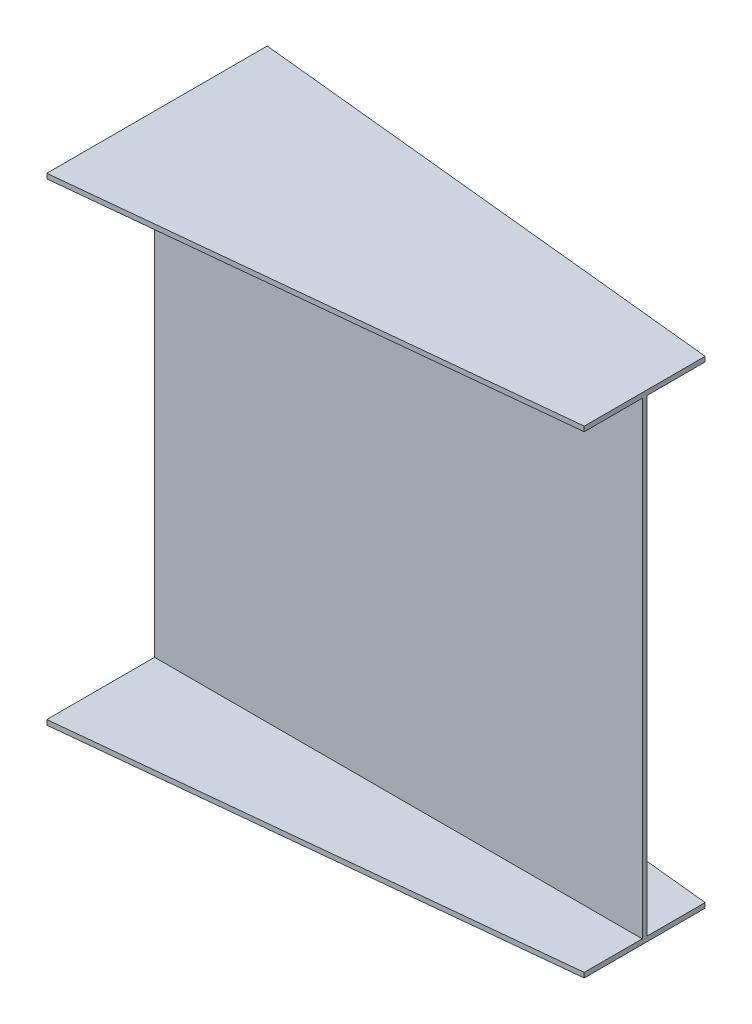
ISO-10303-21;
HEADER;
FILE_DESCRIPTION(('STEP AP214'),'2;1');
FILE_NAME('part.step','',(''),(''),'','','');
FILE_SCHEMA(('AUTOMOTIVE_DESIGN { 1 0 10303 214 1 1 1 1 }'));
ENDSEC;
DATA;
#1=APPLICATION_CONTEXT('core data for automotive mechanical design processes');
#2=APPLICATION_PROTOCOL_DEFINITION('international standard','automotive_design',2000,#1);
#3=PRODUCT_CONTEXT('',#1,'mechanical');
#4=PRODUCT('Part','Part','',(#3));
#5=PRODUCT_RELATED_PRODUCT_CATEGORY('part','',(#4));
#6=PRODUCT_DEFINITION_FORMATION('','',#4);
#7=PRODUCT_DEFINITION_CONTEXT('part definition',#1,'design');
#8=PRODUCT_DEFINITION('design','',#6,#7);
#9=PRODUCT_DEFINITION_SHAPE('','',#8);
#10=(LENGTH_UNIT() NAMED_UNIT(*) SI_UNIT(.MILLI.,.METRE.));
#11=(NAMED_UNIT(*) PLANE_ANGLE_UNIT() SI_UNIT($,.RADIAN.));
#12=(NAMED_UNIT(*) SI_UNIT($,.STERADIAN.) SOLID_ANGLE_UNIT());
#13=UNCERTAINTY_MEASURE_WITH_UNIT(LENGTH_MEASURE(1.E-05),#10,'distance_accuracy_value','');
#14=(GEOMETRIC_REPRESENTATION_CONTEXT(3) GLOBAL_UNCERTAINTY_ASSIGNED_CONTEXT((#13)) GLOBAL_UNIT_ASSIGNED_CONTEXT((#10,
#11,#12)) REPRESENTATION_CONTEXT('',''));
#15=CARTESIAN_POINT('',(0.,0.,0.));
#16=DIRECTION('',(0.,0.,1.));
#17=DIRECTION('',(1.,0.,0.));
#18=AXIS2_PLACEMENT_3D('',#15,#16,#17);
#19=CARTESIAN_POINT('',(1000.,0.,0.));
#20=DIRECTION('',(-1.,0.,0.));
#21=DIRECTION('',(0.,0.,1.));
#22=AXIS2_PLACEMENT_3D('',#19,#20,#21);
#23=PLANE('',#22);
#24=DIRECTION('',(0.,-1.,0.));
#25=VECTOR('',#24,1.);
#26=CARTESIAN_POINT('',(1000.,490.,-119.));
#27=LINE('',#26,#25);
#28=CARTESIAN_POINT('',(1000.,490.,-119.));
#29=VERTEX_POINT('',#28);
#30=CARTESIAN_POINT('',(1000.,480.,-119.));
#31=VERTEX_POINT('',#30);
#32=EDGE_CURVE('E377',#29,#31,#27,.T.);
#33=ORIENTED_EDGE('',*,*,#32,.F.);
#34=DIRECTION('',(0.,0.,-1.));
#35=VECTOR('',#34,1.);
#36=CARTESIAN_POINT('',(1000.,490.,-119.));
#37=LINE('',#36,#35);
#38=CARTESIAN_POINT('',(1000.,490.,129.));
#39=VERTEX_POINT('',#38);
#40=EDGE_CURVE('E12',#39,#29,#37,.T.);
#41=ORIENTED_EDGE('',*,*,#40,.F.);
#42=DIRECTION('',(0.,1.,0.));
#43=VECTOR('',#42,1.);
#44=CARTESIAN_POINT('',(1000.,490.,129.));
#45=LINE('',#44,#43);
#46=CARTESIAN_POINT('',(1000.,480.,129.));
#47=VERTEX_POINT('',#46);
#48=EDGE_CURVE('E71',#47,#39,#45,.T.);
#49=ORIENTED_EDGE('',*,*,#48,.F.);
#50=DIRECTION('',(0.,0.,1.));
#51=VECTOR('',#50,1.);
#52=CARTESIAN_POINT('',(1000.,480.,10.0000000000002));
#53=LINE('',#52,#51);
#54=CARTESIAN_POINT('',(1000.,480.,10.0000000000002));
#55=VERTEX_POINT('',#54);
#56=EDGE_CURVE('E652',#55,#47,#53,.T.);
#57=ORIENTED_EDGE('',*,*,#56,.F.);
#58=DIRECTION('',(0.,1.,0.));
#59=VECTOR('',#58,1.);
#60=CARTESIAN_POINT('',(1000.,480.,10.0000000000002));
#61=LINE('',#60,#59);
#62=CARTESIAN_POINT('',(1000.,-480.,10.0000000000002));
#63=VERTEX_POINT('',#62);
#64=EDGE_CURVE('E414',#63,#55,#61,.T.);
#65=ORIENTED_EDGE('',*,*,#64,.F.);
#66=DIRECTION('',(0.,0.,-1.));
#67=VECTOR('',#66,1.);
#68=CARTESIAN_POINT('',(1000.,-480.,10.0000000000002));
#69=LINE('',#68,#67);
#70=CARTESIAN_POINT('',(1000.,-480.,129.));
#71=VERTEX_POINT('',#70);
#72=EDGE_CURVE('E428',#71,#63,#69,.T.);
#73=ORIENTED_EDGE('',*,*,#72,.F.);
#74=DIRECTION('',(0.,1.,0.));
#75=VECTOR('',#74,1.);
#76=CARTESIAN_POINT('',(1000.,-480.,129.));
#77=LINE('',#76,#75);
#78=CARTESIAN_POINT('',(1000.,-490.,129.));
#79=VERTEX_POINT('',#78);
#80=EDGE_CURVE('E442',#79,#71,#77,.T.);
#81=ORIENTED_EDGE('',*,*,#80,.F.);
#82=DIRECTION('',(0.,0.,1.));
#83=VECTOR('',#82,1.);
#84=CARTESIAN_POINT('',(1000.,-490.,-119.));
#85=LINE('',#84,#83);
#86=CARTESIAN_POINT('',(1000.,-490.,-119.));
#87=VERTEX_POINT('',#86);
#88=EDGE_CURVE('E623',#87,#79,#85,.T.);
#89=ORIENTED_EDGE('',*,*,#88,.F.);
#90=DIRECTION('',(0.,-1.,0.));
#91=VECTOR('',#90,1.);
#92=CARTESIAN_POINT('',(1000.,-480.,-119.));
#93=LINE('',#92,#91);
#94=CARTESIAN_POINT('',(1000.,-480.,-119.));
#95=VERTEX_POINT('',#94);
#96=EDGE_CURVE('E615',#95,#87,#93,.T.);
#97=ORIENTED_EDGE('',*,*,#96,.F.);
#98=DIRECTION('',(0.,0.,-1.));
#99=VECTOR('',#98,1.);
#100=CARTESIAN_POINT('',(1000.,-480.,-119.));
#101=LINE('',#100,#99);
#102=CARTESIAN_POINT('',(1000.,-480.,2.22044604925031E-13));
#103=VERTEX_POINT('',#102);
#104=EDGE_CURVE('E530',#103,#95,#101,.T.);
#105=ORIENTED_EDGE('',*,*,#104,.F.);
#106=DIRECTION('',(0.,-1.,0.));
#107=VECTOR('',#106,1.);
#108=CARTESIAN_POINT('',(1000.,480.,2.22044604925031E-13));
#109=LINE('',#108,#107);
#110=CARTESIAN_POINT('',(1000.,480.,2.22044604925031E-13));
#111=VERTEX_POINT('',#110);
#112=EDGE_CURVE('E85',#111,#103,#109,.T.);
#113=ORIENTED_EDGE('',*,*,#112,.F.);
#114=DIRECTION('',(0.,0.,1.));
#115=VECTOR('',#114,1.);
#116=CARTESIAN_POINT('',(1000.,480.,-119.));
#117=LINE('',#116,#115);
#118=EDGE_CURVE('E79',#31,#111,#117,.T.);
#119=ORIENTED_EDGE('',*,*,#118,.F.);
#120=EDGE_LOOP('',(#33,#41,#49,#57,#65,#73,#81,#89,#97,#105,#113,#119));
#121=FACE_BOUND('',#120,.T.);
#122=ADVANCED_FACE('F61',(#121),#23,.F.);
#123=CARTESIAN_POINT('',(0.,0.,0.));
#124=DIRECTION('',(1.,0.,0.));
#125=DIRECTION('',(0.,0.,-1.));
#126=AXIS2_PLACEMENT_3D('',#123,#124,#125);
#127=PLANE('',#126);
#128=DIRECTION('',(0.,-1.,0.));
#129=VECTOR('',#128,1.);
#130=CARTESIAN_POINT('',(0.,490.,231.000000000001));
#131=LINE('',#130,#129);
#132=CARTESIAN_POINT('',(0.,490.,231.000000000001));
#133=VERTEX_POINT('',#132);
#134=CARTESIAN_POINT('',(0.,480.,231.000000000001));
#135=VERTEX_POINT('',#134);
#136=EDGE_CURVE('E160',#133,#135,#131,.T.);
#137=ORIENTED_EDGE('',*,*,#136,.F.);
#138=DIRECTION('',(0.,0.,1.));
#139=VECTOR('',#138,1.);
#140=CARTESIAN_POINT('',(0.,490.,231.000000000001));
#141=LINE('',#140,#139);
#142=CARTESIAN_POINT('',(0.,490.,-220.999999999999));
#143=VERTEX_POINT('',#142);
#144=EDGE_CURVE('E169',#143,#133,#141,.T.);
#145=ORIENTED_EDGE('',*,*,#144,.F.);
#146=DIRECTION('',(0.,1.,0.));
#147=VECTOR('',#146,1.);
#148=CARTESIAN_POINT('',(0.,490.,-220.999999999999));
#149=LINE('',#148,#147);
#150=CARTESIAN_POINT('',(0.,480.,-220.999999999999));
#151=VERTEX_POINT('',#150);
#152=EDGE_CURVE('E176',#151,#143,#149,.T.);
#153=ORIENTED_EDGE('',*,*,#152,.F.);
#154=DIRECTION('',(0.,0.,-1.));
#155=VECTOR('',#154,1.);
#156=CARTESIAN_POINT('',(0.,480.,4.7415678223917E-13));
#157=LINE('',#156,#155);
#158=CARTESIAN_POINT('',(0.,480.,4.7415678223917E-13));
#159=VERTEX_POINT('',#158);
#160=EDGE_CURVE('E300',#159,#151,#157,.T.);
#161=ORIENTED_EDGE('',*,*,#160,.F.);
#162=DIRECTION('',(0.,1.,0.));
#163=VECTOR('',#162,1.);
#164=CARTESIAN_POINT('',(0.,480.,4.7415678223917E-13));
#165=LINE('',#164,#163);
#166=CARTESIAN_POINT('',(0.,-480.,4.7415678223917E-13));
#167=VERTEX_POINT('',#166);
#168=EDGE_CURVE('E296',#167,#159,#165,.T.);
#169=ORIENTED_EDGE('',*,*,#168,.F.);
#170=DIRECTION('',(0.,0.,1.));
#171=VECTOR('',#170,1.);
#172=CARTESIAN_POINT('',(0.,-480.,4.7415678223917E-13));
#173=LINE('',#172,#171);
#174=CARTESIAN_POINT('',(0.,-480.,-221.));
#175=VERTEX_POINT('',#174);
#176=EDGE_CURVE('E292',#175,#167,#173,.T.);
#177=ORIENTED_EDGE('',*,*,#176,.F.);
#178=DIRECTION('',(0.,1.,0.));
#179=VECTOR('',#178,1.);
#180=CARTESIAN_POINT('',(0.,-480.,-221.));
#181=LINE('',#180,#179);
#182=CARTESIAN_POINT('',(0.,-490.,-221.));
#183=VERTEX_POINT('',#182);
#184=EDGE_CURVE('E288',#183,#175,#181,.T.);
#185=ORIENTED_EDGE('',*,*,#184,.F.);
#186=DIRECTION('',(0.,0.,-1.));
#187=VECTOR('',#186,1.);
#188=CARTESIAN_POINT('',(0.,-490.,231.));
#189=LINE('',#188,#187);
#190=CARTESIAN_POINT('',(0.,-490.,231.));
#191=VERTEX_POINT('',#190);
#192=EDGE_CURVE('E284',#191,#183,#189,.T.);
#193=ORIENTED_EDGE('',*,*,#192,.F.);
#194=DIRECTION('',(0.,-1.,0.));
#195=VECTOR('',#194,1.);
#196=CARTESIAN_POINT('',(0.,-480.,231.));
#197=LINE('',#196,#195);
#198=CARTESIAN_POINT('',(0.,-480.,231.));
#199=VERTEX_POINT('',#198);
#200=EDGE_CURVE('E280',#199,#191,#197,.T.);
#201=ORIENTED_EDGE('',*,*,#200,.F.);
#202=DIRECTION('',(0.,0.,1.));
#203=VECTOR('',#202,1.);
#204=CARTESIAN_POINT('',(0.,-480.,231.));
#205=LINE('',#204,#203);
#206=CARTESIAN_POINT('',(0.,-480.,10.0000000000005));
#207=VERTEX_POINT('',#206);
#208=EDGE_CURVE('E275',#207,#199,#205,.T.);
#209=ORIENTED_EDGE('',*,*,#208,.F.);
#210=DIRECTION('',(0.,-1.,0.));
#211=VECTOR('',#210,1.);
#212=CARTESIAN_POINT('',(0.,480.,10.0000000000005));
#213=LINE('',#212,#211);
#214=CARTESIAN_POINT('',(0.,480.,10.0000000000005));
#215=VERTEX_POINT('',#214);
#216=EDGE_CURVE('E273',#215,#207,#213,.T.);
#217=ORIENTED_EDGE('',*,*,#216,.F.);
#218=DIRECTION('',(0.,0.,-1.));
#219=VECTOR('',#218,1.);
#220=CARTESIAN_POINT('',(0.,480.,231.000000000001));
#221=LINE('',#220,#219);
#222=EDGE_CURVE('E182',#135,#215,#221,.T.);
#223=ORIENTED_EDGE('',*,*,#222,.F.);
#224=EDGE_LOOP('',(#137,#145,#153,#161,#169,#177,#185,#193,#201,#209,#217,#223));
#225=FACE_BOUND('',#224,.T.);
#226=ADVANCED_FACE('F180',(#225),#127,.F.);
#227=CARTESIAN_POINT('',(0.,0.,10.0000000000005));
#228=DIRECTION('',(0.,0.,1.));
#229=DIRECTION('',(1.,0.,0.));
#230=AXIS2_PLACEMENT_3D('',#227,#228,#229);
#231=PLANE('',#230);
#232=DIRECTION('',(1.,0.,0.));
#233=VECTOR('',#232,1.);
#234=CARTESIAN_POINT('',(0.,-480.,10.0000000000005));
#235=LINE('',#234,#233);
#236=EDGE_CURVE('E175',#207,#63,#235,.T.);
#237=ORIENTED_EDGE('',*,*,#236,.T.);
#238=ORIENTED_EDGE('',*,*,#64,.T.);
#239=DIRECTION('',(1.,0.,0.));
#240=VECTOR('',#239,1.);
#241=CARTESIAN_POINT('',(0.,480.,10.0000000000005));
#242=LINE('',#241,#240);
#243=EDGE_CURVE('E387',#215,#55,#242,.T.);
#244=ORIENTED_EDGE('',*,*,#243,.F.);
#245=ORIENTED_EDGE('',*,*,#216,.T.);
#246=EDGE_LOOP('',(#237,#238,#244,#245));
#247=FACE_BOUND('',#246,.T.);
#248=ADVANCED_FACE('F203',(#247),#231,.T.);
#249=CARTESIAN_POINT('',(0.,480.,0.));
#250=DIRECTION('',(0.,-1.,0.));
#251=DIRECTION('',(1.,0.,0.));
#252=AXIS2_PLACEMENT_3D('',#249,#250,#251);
#253=PLANE('',#252);
#254=ORIENTED_EDGE('',*,*,#243,.T.);
#255=ORIENTED_EDGE('',*,*,#56,.T.);
#256=DIRECTION('',(0.994838242454285,0.,-0.101473500730337));
#257=VECTOR('',#256,1.);
#258=CARTESIAN_POINT('',(0.,480.,231.000000000001));
#259=LINE('',#258,#257);
#260=EDGE_CURVE('E165',#135,#47,#259,.T.);
#261=ORIENTED_EDGE('',*,*,#260,.F.);
#262=ORIENTED_EDGE('',*,*,#222,.T.);
#263=EDGE_LOOP('',(#254,#255,#261,#262));
#264=FACE_BOUND('',#263,.T.);
#265=ADVANCED_FACE('F389',(#264),#253,.T.);
#266=CARTESIAN_POINT('',(0.,-480.,0.));
#267=DIRECTION('',(0.,1.,0.));
#268=DIRECTION('',(-1.,0.,0.));
#269=AXIS2_PLACEMENT_3D('',#266,#267,#268);
#270=PLANE('',#269);
#271=DIRECTION('',(0.994838242454285,0.,-0.101473500730337));
#272=VECTOR('',#271,1.);
#273=CARTESIAN_POINT('',(0.,-480.,231.));
#274=LINE('',#273,#272);
#275=EDGE_CURVE('E475',#199,#71,#274,.T.);
#276=ORIENTED_EDGE('',*,*,#275,.T.);
#277=ORIENTED_EDGE('',*,*,#72,.T.);
#278=ORIENTED_EDGE('',*,*,#236,.F.);
#279=ORIENTED_EDGE('',*,*,#208,.T.);
#280=EDGE_LOOP('',(#276,#277,#278,#279));
#281=FACE_BOUND('',#280,.T.);
#282=ADVANCED_FACE('F398',(#281),#270,.T.);
#283=CARTESIAN_POINT('',(23.3193851172402,0.,228.621422718042));
#284=DIRECTION('',(0.101473500730337,0.,0.994838242454285));
#285=DIRECTION('',(0.994838242454285,0.,-0.101473500730337));
#286=AXIS2_PLACEMENT_3D('',#283,#284,#285);
#287=PLANE('',#286);
#288=DIRECTION('',(0.994838242454285,0.,-0.101473500730337));
#289=VECTOR('',#288,1.);
#290=CARTESIAN_POINT('',(0.,-490.,231.));
#291=LINE('',#290,#289);
#292=EDGE_CURVE('E467',#191,#79,#291,.T.);
#293=ORIENTED_EDGE('',*,*,#292,.T.);
#294=ORIENTED_EDGE('',*,*,#80,.T.);
#295=ORIENTED_EDGE('',*,*,#275,.F.);
#296=ORIENTED_EDGE('',*,*,#200,.T.);
#297=EDGE_LOOP('',(#293,#294,#295,#296));
#298=FACE_BOUND('',#297,.T.);
#299=ADVANCED_FACE('F448',(#298),#287,.T.);
#300=CARTESIAN_POINT('',(0.,-490.,0.));
#301=DIRECTION('',(0.,-1.,0.));
#302=DIRECTION('',(1.,0.,0.));
#303=AXIS2_PLACEMENT_3D('',#300,#301,#302);
#304=PLANE('',#303);
#305=DIRECTION('',(0.994838242454285,0.,0.101473500730337));
#306=VECTOR('',#305,1.);
#307=CARTESIAN_POINT('',(0.,-490.,-221.));
#308=LINE('',#307,#306);
#309=EDGE_CURVE('E474',#183,#87,#308,.T.);
#310=ORIENTED_EDGE('',*,*,#309,.T.);
#311=ORIENTED_EDGE('',*,*,#88,.T.);
#312=ORIENTED_EDGE('',*,*,#292,.F.);
#313=ORIENTED_EDGE('',*,*,#192,.T.);
#314=EDGE_LOOP('',(#310,#311,#312,#313));
#315=FACE_BOUND('',#314,.T.);
#316=ADVANCED_FACE('F457',(#315),#304,.T.);
#317=CARTESIAN_POINT('',(22.3098879260177,0.,-218.724391431546));
#318=DIRECTION('',(0.101473500730337,0.,-0.994838242454285));
#319=DIRECTION('',(-0.994838242454285,0.,-0.101473500730337));
#320=AXIS2_PLACEMENT_3D('',#317,#318,#319);
#321=PLANE('',#320);
#322=DIRECTION('',(0.994838242454285,0.,0.101473500730337));
#323=VECTOR('',#322,1.);
#324=CARTESIAN_POINT('',(0.,-480.,-221.));
#325=LINE('',#324,#323);
#326=EDGE_CURVE('E492',#175,#95,#325,.T.);
#327=ORIENTED_EDGE('',*,*,#326,.T.);
#328=ORIENTED_EDGE('',*,*,#96,.T.);
#329=ORIENTED_EDGE('',*,*,#309,.F.);
#330=ORIENTED_EDGE('',*,*,#184,.T.);
#331=EDGE_LOOP('',(#327,#328,#329,#330));
#332=FACE_BOUND('',#331,.T.);
#333=ADVANCED_FACE('F503',(#332),#321,.T.);
#334=CARTESIAN_POINT('',(0.,-480.,0.));
#335=DIRECTION('',(0.,1.,0.));
#336=DIRECTION('',(0.,0.,1.));
#337=AXIS2_PLACEMENT_3D('',#334,#335,#336);
#338=PLANE('',#337);
#339=DIRECTION('',(1.,0.,0.));
#340=VECTOR('',#339,1.);
#341=CARTESIAN_POINT('',(0.,-480.,4.7415678223917E-13));
#342=LINE('',#341,#340);
#343=EDGE_CURVE('E569',#167,#103,#342,.T.);
#344=ORIENTED_EDGE('',*,*,#343,.T.);
#345=ORIENTED_EDGE('',*,*,#104,.T.);
#346=ORIENTED_EDGE('',*,*,#326,.F.);
#347=ORIENTED_EDGE('',*,*,#176,.T.);
#348=EDGE_LOOP('',(#344,#345,#346,#347));
#349=FACE_BOUND('',#348,.T.);
#350=ADVANCED_FACE('F512',(#349),#338,.T.);
#351=CARTESIAN_POINT('',(0.,0.,4.7415678223917E-13));
#352=DIRECTION('',(0.,0.,-1.));
#353=DIRECTION('',(-1.,0.,0.));
#354=AXIS2_PLACEMENT_3D('',#351,#352,#353);
#355=PLANE('',#354);
#356=DIRECTION('',(1.,0.,0.));
#357=VECTOR('',#356,1.);
#358=CARTESIAN_POINT('',(0.,480.,4.7415678223917E-13));
#359=LINE('',#358,#357);
#360=EDGE_CURVE('E561',#159,#111,#359,.T.);
#361=ORIENTED_EDGE('',*,*,#360,.T.);
#362=ORIENTED_EDGE('',*,*,#112,.T.);
#363=ORIENTED_EDGE('',*,*,#343,.F.);
#364=ORIENTED_EDGE('',*,*,#168,.T.);
#365=EDGE_LOOP('',(#361,#362,#363,#364));
#366=FACE_BOUND('',#365,.T.);
#367=ADVANCED_FACE('F546',(#366),#355,.T.);
#368=CARTESIAN_POINT('',(0.,480.,0.));
#369=DIRECTION('',(0.,-1.,0.));
#370=DIRECTION('',(1.,0.,0.));
#371=AXIS2_PLACEMENT_3D('',#368,#369,#370);
#372=PLANE('',#371);
#373=DIRECTION('',(0.994838242454285,0.,0.101473500730337));
#374=VECTOR('',#373,1.);
#375=CARTESIAN_POINT('',(0.,480.,-220.999999999999));
#376=LINE('',#375,#374);
#377=EDGE_CURVE('E568',#151,#31,#376,.T.);
#378=ORIENTED_EDGE('',*,*,#377,.T.);
#379=ORIENTED_EDGE('',*,*,#118,.T.);
#380=ORIENTED_EDGE('',*,*,#360,.F.);
#381=ORIENTED_EDGE('',*,*,#160,.T.);
#382=EDGE_LOOP('',(#378,#379,#380,#381));
#383=FACE_BOUND('',#382,.T.);
#384=ADVANCED_FACE('F327',(#383),#372,.T.);
#385=CARTESIAN_POINT('',(22.3098879260176,0.,-218.724391431546));
#386=DIRECTION('',(0.101473500730337,0.,-0.994838242454285));
#387=DIRECTION('',(-0.994838242454285,0.,-0.101473500730337));
#388=AXIS2_PLACEMENT_3D('',#385,#386,#387);
#389=PLANE('',#388);
#390=DIRECTION('',(0.994838242454285,0.,0.101473500730337));
#391=VECTOR('',#390,1.);
#392=CARTESIAN_POINT('',(0.,490.,-220.999999999999));
#393=LINE('',#392,#391);
#394=EDGE_CURVE('E166',#143,#29,#393,.T.);
#395=ORIENTED_EDGE('',*,*,#394,.T.);
#396=ORIENTED_EDGE('',*,*,#32,.T.);
#397=ORIENTED_EDGE('',*,*,#377,.F.);
#398=ORIENTED_EDGE('',*,*,#152,.T.);
#399=EDGE_LOOP('',(#395,#396,#397,#398));
#400=FACE_BOUND('',#399,.T.);
#401=ADVANCED_FACE('F317',(#400),#389,.T.);
#402=CARTESIAN_POINT('',(0.,490.,0.));
#403=DIRECTION('',(0.,1.,0.));
#404=DIRECTION('',(0.,0.,1.));
#405=AXIS2_PLACEMENT_3D('',#402,#403,#404);
#406=PLANE('',#405);
#407=DIRECTION('',(0.994838242454285,0.,-0.101473500730337));
#408=VECTOR('',#407,1.);
#409=CARTESIAN_POINT('',(0.,490.,231.000000000001));
#410=LINE('',#409,#408);
#411=EDGE_CURVE('E155',#133,#39,#410,.T.);
#412=ORIENTED_EDGE('',*,*,#411,.T.);
#413=ORIENTED_EDGE('',*,*,#40,.T.);
#414=ORIENTED_EDGE('',*,*,#394,.F.);
#415=ORIENTED_EDGE('',*,*,#144,.T.);
#416=EDGE_LOOP('',(#412,#413,#414,#415));
#417=FACE_BOUND('',#416,.T.);
#418=ADVANCED_FACE('F171',(#417),#406,.T.);
#419=CARTESIAN_POINT('',(23.3193851172403,0.,228.621422718042));
#420=DIRECTION('',(0.101473500730337,0.,0.994838242454285));
#421=DIRECTION('',(0.994838242454285,0.,-0.101473500730337));
#422=AXIS2_PLACEMENT_3D('',#419,#420,#421);
#423=PLANE('',#422);
#424=ORIENTED_EDGE('',*,*,#260,.T.);
#425=ORIENTED_EDGE('',*,*,#48,.T.);
#426=ORIENTED_EDGE('',*,*,#411,.F.);
#427=ORIENTED_EDGE('',*,*,#136,.T.);
#428=EDGE_LOOP('',(#424,#425,#426,#427));
#429=FACE_BOUND('',#428,.T.);
#430=ADVANCED_FACE('F158',(#429),#423,.T.);
#431=CLOSED_SHELL('',(#122,#226,#248,#265,#282,#299,#316,#333,#350,#367,#384,#401,#418,#430));
#432=MANIFOLD_SOLID_BREP('B2',#431);
#433=ADVANCED_BREP_SHAPE_REPRESENTATION('',(#18,#432),#14);
#434=SHAPE_DEFINITION_REPRESENTATION(#9,#433);
ENDSEC;
END-ISO-10303-21;
